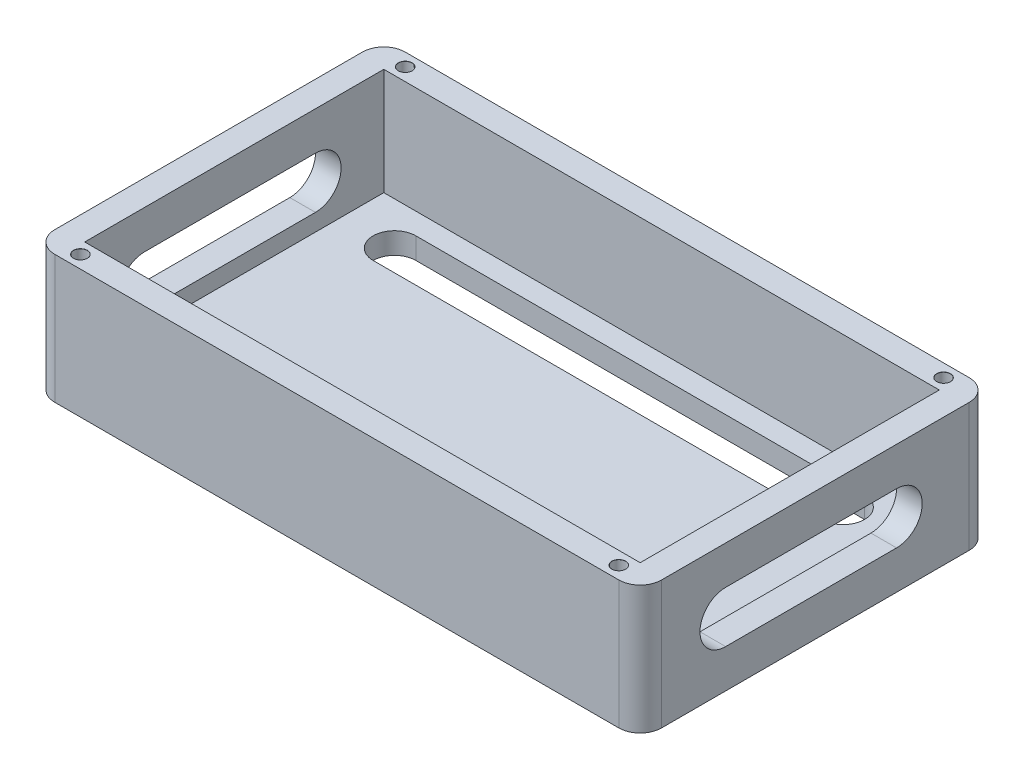
ISO-10303-21;
HEADER;
FILE_DESCRIPTION(('STEP AP214'),'2;1');
FILE_NAME('part.step','',(''),(''),'','','');
FILE_SCHEMA(('AUTOMOTIVE_DESIGN { 1 0 10303 214 1 1 1 1 }'));
ENDSEC;
DATA;
#1=APPLICATION_CONTEXT('core data for automotive mechanical design processes');
#2=APPLICATION_PROTOCOL_DEFINITION('international standard','automotive_design',2000,#1);
#3=PRODUCT_CONTEXT('',#1,'mechanical');
#4=PRODUCT('Part','Part','',(#3));
#5=PRODUCT_RELATED_PRODUCT_CATEGORY('part','',(#4));
#6=PRODUCT_DEFINITION_FORMATION('','',#4);
#7=PRODUCT_DEFINITION_CONTEXT('part definition',#1,'design');
#8=PRODUCT_DEFINITION('design','',#6,#7);
#9=PRODUCT_DEFINITION_SHAPE('','',#8);
#10=(LENGTH_UNIT() NAMED_UNIT(*) SI_UNIT(.MILLI.,.METRE.));
#11=(NAMED_UNIT(*) PLANE_ANGLE_UNIT() SI_UNIT($,.RADIAN.));
#12=(NAMED_UNIT(*) SI_UNIT($,.STERADIAN.) SOLID_ANGLE_UNIT());
#13=UNCERTAINTY_MEASURE_WITH_UNIT(LENGTH_MEASURE(1.E-05),#10,'distance_accuracy_value','');
#14=(GEOMETRIC_REPRESENTATION_CONTEXT(3) GLOBAL_UNCERTAINTY_ASSIGNED_CONTEXT((#13)) GLOBAL_UNIT_ASSIGNED_CONTEXT((#10,
#11,#12)) REPRESENTATION_CONTEXT('',''));
#15=CARTESIAN_POINT('',(0.,0.,0.));
#16=DIRECTION('',(0.,0.,1.));
#17=DIRECTION('',(1.,0.,0.));
#18=AXIS2_PLACEMENT_3D('',#15,#16,#17);
#19=CARTESIAN_POINT('',(71.,30.,41.));
#20=DIRECTION('',(-1.,0.,0.));
#21=DIRECTION('',(0.,0.,1.));
#22=AXIS2_PLACEMENT_3D('',#19,#20,#21);
#23=PLANE('',#22);
#24=DIRECTION('',(0.,0.,-1.));
#25=VECTOR('',#24,1.);
#26=CARTESIAN_POINT('',(71.,9.,21.));
#27=LINE('',#26,#25);
#28=CARTESIAN_POINT('',(71.,9.,21.));
#29=VERTEX_POINT('',#28);
#30=CARTESIAN_POINT('',(71.,9.,-19.));
#31=VERTEX_POINT('',#30);
#32=EDGE_CURVE('E265',#29,#31,#27,.T.);
#33=ORIENTED_EDGE('',*,*,#32,.F.);
#34=CARTESIAN_POINT('',(71.,15.,21.));
#35=DIRECTION('',(1.,0.,0.));
#36=DIRECTION('',(0.,0.,-1.));
#37=AXIS2_PLACEMENT_3D('',#34,#35,#36);
#38=CIRCLE('',#37,6.);
#39=CARTESIAN_POINT('',(71.,21.,21.));
#40=VERTEX_POINT('',#39);
#41=EDGE_CURVE('E55',#40,#29,#38,.T.);
#42=ORIENTED_EDGE('',*,*,#41,.F.);
#43=DIRECTION('',(0.,0.,1.));
#44=VECTOR('',#43,1.);
#45=CARTESIAN_POINT('',(71.,21.,21.));
#46=LINE('',#45,#44);
#47=CARTESIAN_POINT('',(71.,21.,-19.));
#48=VERTEX_POINT('',#47);
#49=EDGE_CURVE('E252',#48,#40,#46,.T.);
#50=ORIENTED_EDGE('',*,*,#49,.F.);
#51=CARTESIAN_POINT('',(71.,15.,-19.));
#52=DIRECTION('',(1.,0.,0.));
#53=DIRECTION('',(0.,0.,-1.));
#54=AXIS2_PLACEMENT_3D('',#51,#52,#53);
#55=CIRCLE('',#54,6.);
#56=EDGE_CURVE('E256',#31,#48,#55,.T.);
#57=ORIENTED_EDGE('',*,*,#56,.F.);
#58=EDGE_LOOP('',(#33,#42,#50,#57));
#59=FACE_BOUND('',#58,.T.);
#60=DIRECTION('',(0.,0.,-1.));
#61=VECTOR('',#60,1.);
#62=CARTESIAN_POINT('',(71.,0.,41.));
#63=LINE('',#62,#61);
#64=CARTESIAN_POINT('',(71.,0.,36.));
#65=VERTEX_POINT('',#64);
#66=CARTESIAN_POINT('',(71.,0.,-36.));
#67=VERTEX_POINT('',#66);
#68=EDGE_CURVE('E468',#65,#67,#63,.T.);
#69=ORIENTED_EDGE('',*,*,#68,.T.);
#70=DIRECTION('',(0.,-1.,0.));
#71=VECTOR('',#70,1.);
#72=CARTESIAN_POINT('',(71.,30.,-36.));
#73=LINE('',#72,#71);
#74=CARTESIAN_POINT('',(71.,30.,-36.));
#75=VERTEX_POINT('',#74);
#76=EDGE_CURVE('E551',#67,#75,#73,.F.);
#77=ORIENTED_EDGE('',*,*,#76,.T.);
#78=DIRECTION('',(0.,0.,-1.));
#79=VECTOR('',#78,1.);
#80=CARTESIAN_POINT('',(71.,30.,41.));
#81=LINE('',#80,#79);
#82=CARTESIAN_POINT('',(71.,30.,36.));
#83=VERTEX_POINT('',#82);
#84=EDGE_CURVE('E478',#83,#75,#81,.T.);
#85=ORIENTED_EDGE('',*,*,#84,.F.);
#86=DIRECTION('',(0.,-1.,0.));
#87=VECTOR('',#86,1.);
#88=CARTESIAN_POINT('',(71.,30.,36.));
#89=LINE('',#88,#87);
#90=EDGE_CURVE('E547',#83,#65,#89,.T.);
#91=ORIENTED_EDGE('',*,*,#90,.T.);
#92=EDGE_LOOP('',(#69,#77,#85,#91));
#93=FACE_BOUND('',#92,.T.);
#94=ADVANCED_FACE('F39',(#59,#93),#23,.F.);
#95=CARTESIAN_POINT('',(-71.,30.,-41.));
#96=DIRECTION('',(0.,0.,1.));
#97=DIRECTION('',(1.,0.,0.));
#98=AXIS2_PLACEMENT_3D('',#95,#96,#97);
#99=PLANE('',#98);
#100=DIRECTION('',(-1.,0.,0.));
#101=VECTOR('',#100,1.);
#102=CARTESIAN_POINT('',(-71.,0.,-41.));
#103=LINE('',#102,#101);
#104=CARTESIAN_POINT('',(66.,0.,-41.));
#105=VERTEX_POINT('',#104);
#106=CARTESIAN_POINT('',(-66.,0.,-41.));
#107=VERTEX_POINT('',#106);
#108=EDGE_CURVE('E499',#105,#107,#103,.T.);
#109=ORIENTED_EDGE('',*,*,#108,.T.);
#110=DIRECTION('',(0.,-1.,0.));
#111=VECTOR('',#110,1.);
#112=CARTESIAN_POINT('',(-66.,30.,-41.));
#113=LINE('',#112,#111);
#114=CARTESIAN_POINT('',(-66.,30.,-41.));
#115=VERTEX_POINT('',#114);
#116=EDGE_CURVE('E532',#107,#115,#113,.F.);
#117=ORIENTED_EDGE('',*,*,#116,.T.);
#118=DIRECTION('',(-1.,0.,0.));
#119=VECTOR('',#118,1.);
#120=CARTESIAN_POINT('',(-71.,30.,-41.));
#121=LINE('',#120,#119);
#122=CARTESIAN_POINT('',(66.,30.,-41.));
#123=VERTEX_POINT('',#122);
#124=EDGE_CURVE('E482',#123,#115,#121,.T.);
#125=ORIENTED_EDGE('',*,*,#124,.F.);
#126=DIRECTION('',(0.,-1.,0.));
#127=VECTOR('',#126,1.);
#128=CARTESIAN_POINT('',(66.,30.,-41.));
#129=LINE('',#128,#127);
#130=EDGE_CURVE('E528',#123,#105,#129,.T.);
#131=ORIENTED_EDGE('',*,*,#130,.T.);
#132=EDGE_LOOP('',(#109,#117,#125,#131));
#133=FACE_BOUND('',#132,.T.);
#134=ADVANCED_FACE('F590',(#133),#99,.F.);
#135=CARTESIAN_POINT('',(-71.,30.,41.));
#136=DIRECTION('',(1.,0.,0.));
#137=DIRECTION('',(0.,0.,-1.));
#138=AXIS2_PLACEMENT_3D('',#135,#136,#137);
#139=PLANE('',#138);
#140=DIRECTION('',(0.,0.,1.));
#141=VECTOR('',#140,1.);
#142=CARTESIAN_POINT('',(-71.,21.,21.));
#143=LINE('',#142,#141);
#144=CARTESIAN_POINT('',(-71.,21.,-19.));
#145=VERTEX_POINT('',#144);
#146=CARTESIAN_POINT('',(-71.,21.,21.));
#147=VERTEX_POINT('',#146);
#148=EDGE_CURVE('E250',#145,#147,#143,.T.);
#149=ORIENTED_EDGE('',*,*,#148,.T.);
#150=CARTESIAN_POINT('',(-71.,15.,21.));
#151=DIRECTION('',(1.,0.,0.));
#152=DIRECTION('',(0.,0.,-1.));
#153=AXIS2_PLACEMENT_3D('',#150,#151,#152);
#154=CIRCLE('',#153,6.);
#155=CARTESIAN_POINT('',(-71.,9.,21.));
#156=VERTEX_POINT('',#155);
#157=EDGE_CURVE('E232',#147,#156,#154,.T.);
#158=ORIENTED_EDGE('',*,*,#157,.T.);
#159=DIRECTION('',(0.,0.,-1.));
#160=VECTOR('',#159,1.);
#161=CARTESIAN_POINT('',(-71.,9.,21.));
#162=LINE('',#161,#160);
#163=CARTESIAN_POINT('',(-71.,9.,-19.));
#164=VERTEX_POINT('',#163);
#165=EDGE_CURVE('E241',#156,#164,#162,.T.);
#166=ORIENTED_EDGE('',*,*,#165,.T.);
#167=CARTESIAN_POINT('',(-71.,15.,-19.));
#168=DIRECTION('',(1.,0.,0.));
#169=DIRECTION('',(0.,0.,-1.));
#170=AXIS2_PLACEMENT_3D('',#167,#168,#169);
#171=CIRCLE('',#170,6.);
#172=EDGE_CURVE('E63',#164,#145,#171,.T.);
#173=ORIENTED_EDGE('',*,*,#172,.T.);
#174=EDGE_LOOP('',(#149,#158,#166,#173));
#175=FACE_BOUND('',#174,.T.);
#176=DIRECTION('',(0.,0.,1.));
#177=VECTOR('',#176,1.);
#178=CARTESIAN_POINT('',(-71.,30.,41.));
#179=LINE('',#178,#177);
#180=CARTESIAN_POINT('',(-71.,30.,-36.));
#181=VERTEX_POINT('',#180);
#182=CARTESIAN_POINT('',(-71.,30.,36.));
#183=VERTEX_POINT('',#182);
#184=EDGE_CURVE('E487',#181,#183,#179,.T.);
#185=ORIENTED_EDGE('',*,*,#184,.F.);
#186=DIRECTION('',(0.,-1.,0.));
#187=VECTOR('',#186,1.);
#188=CARTESIAN_POINT('',(-71.,30.,-36.));
#189=LINE('',#188,#187);
#190=CARTESIAN_POINT('',(-71.,0.,-36.));
#191=VERTEX_POINT('',#190);
#192=EDGE_CURVE('E512',#181,#191,#189,.T.);
#193=ORIENTED_EDGE('',*,*,#192,.T.);
#194=DIRECTION('',(0.,0.,1.));
#195=VECTOR('',#194,1.);
#196=CARTESIAN_POINT('',(-71.,0.,41.));
#197=LINE('',#196,#195);
#198=CARTESIAN_POINT('',(-71.,0.,36.));
#199=VERTEX_POINT('',#198);
#200=EDGE_CURVE('E503',#191,#199,#197,.T.);
#201=ORIENTED_EDGE('',*,*,#200,.T.);
#202=DIRECTION('',(0.,-1.,0.));
#203=VECTOR('',#202,1.);
#204=CARTESIAN_POINT('',(-71.,30.,36.));
#205=LINE('',#204,#203);
#206=EDGE_CURVE('E495',#199,#183,#205,.F.);
#207=ORIENTED_EDGE('',*,*,#206,.T.);
#208=EDGE_LOOP('',(#185,#193,#201,#207));
#209=FACE_BOUND('',#208,.T.);
#210=ADVANCED_FACE('F247',(#175,#209),#139,.F.);
#211=CARTESIAN_POINT('',(-71.,30.,41.));
#212=DIRECTION('',(0.,0.,-1.));
#213=DIRECTION('',(-1.,0.,0.));
#214=AXIS2_PLACEMENT_3D('',#211,#212,#213);
#215=PLANE('',#214);
#216=DIRECTION('',(1.,0.,0.));
#217=VECTOR('',#216,1.);
#218=CARTESIAN_POINT('',(-71.,0.,41.));
#219=LINE('',#218,#217);
#220=CARTESIAN_POINT('',(-66.,0.,41.));
#221=VERTEX_POINT('',#220);
#222=CARTESIAN_POINT('',(66.,0.,41.));
#223=VERTEX_POINT('',#222);
#224=EDGE_CURVE('E483',#221,#223,#219,.T.);
#225=ORIENTED_EDGE('',*,*,#224,.T.);
#226=DIRECTION('',(0.,-1.,0.));
#227=VECTOR('',#226,1.);
#228=CARTESIAN_POINT('',(66.,30.,41.));
#229=LINE('',#228,#227);
#230=CARTESIAN_POINT('',(66.,30.,41.));
#231=VERTEX_POINT('',#230);
#232=EDGE_CURVE('E558',#223,#231,#229,.F.);
#233=ORIENTED_EDGE('',*,*,#232,.T.);
#234=DIRECTION('',(1.,0.,0.));
#235=VECTOR('',#234,1.);
#236=CARTESIAN_POINT('',(-71.,30.,41.));
#237=LINE('',#236,#235);
#238=CARTESIAN_POINT('',(-66.,30.,41.));
#239=VERTEX_POINT('',#238);
#240=EDGE_CURVE('E491',#239,#231,#237,.T.);
#241=ORIENTED_EDGE('',*,*,#240,.F.);
#242=DIRECTION('',(0.,-1.,0.));
#243=VECTOR('',#242,1.);
#244=CARTESIAN_POINT('',(-66.,30.,41.));
#245=LINE('',#244,#243);
#246=EDGE_CURVE('E554',#239,#221,#245,.T.);
#247=ORIENTED_EDGE('',*,*,#246,.T.);
#248=EDGE_LOOP('',(#225,#233,#241,#247));
#249=FACE_BOUND('',#248,.T.);
#250=ADVANCED_FACE('F640',(#249),#215,.F.);
#251=CARTESIAN_POINT('',(0.,30.,0.));
#252=DIRECTION('',(0.,-1.,0.));
#253=DIRECTION('',(0.,0.,-1.));
#254=AXIS2_PLACEMENT_3D('',#251,#252,#253);
#255=PLANE('',#254);
#256=CARTESIAN_POINT('',(63.,30.,38.));
#257=DIRECTION('',(0.,1.,0.));
#258=DIRECTION('',(0.,0.,1.));
#259=AXIS2_PLACEMENT_3D('',#256,#257,#258);
#260=CIRCLE('',#259,1.625);
#261=CARTESIAN_POINT('',(63.,30.,39.625));
#262=VERTEX_POINT('',#261);
#263=EDGE_CURVE('E344',#262,#262,#260,.T.);
#264=ORIENTED_EDGE('',*,*,#263,.F.);
#265=EDGE_LOOP('',(#264));
#266=FACE_BOUND('',#265,.T.);
#267=CARTESIAN_POINT('',(63.,30.,-38.));
#268=DIRECTION('',(0.,1.,0.));
#269=DIRECTION('',(0.,0.,1.));
#270=AXIS2_PLACEMENT_3D('',#267,#268,#269);
#271=CIRCLE('',#270,1.625);
#272=CARTESIAN_POINT('',(63.,30.,-36.375));
#273=VERTEX_POINT('',#272);
#274=EDGE_CURVE('E397',#273,#273,#271,.T.);
#275=ORIENTED_EDGE('',*,*,#274,.F.);
#276=EDGE_LOOP('',(#275));
#277=FACE_BOUND('',#276,.T.);
#278=CARTESIAN_POINT('',(-63.,30.,-38.));
#279=DIRECTION('',(0.,1.,0.));
#280=DIRECTION('',(0.,0.,1.));
#281=AXIS2_PLACEMENT_3D('',#278,#279,#280);
#282=CIRCLE('',#281,1.625);
#283=CARTESIAN_POINT('',(-63.,30.,-36.375));
#284=VERTEX_POINT('',#283);
#285=EDGE_CURVE('E409',#284,#284,#282,.T.);
#286=ORIENTED_EDGE('',*,*,#285,.F.);
#287=EDGE_LOOP('',(#286));
#288=FACE_BOUND('',#287,.T.);
#289=CARTESIAN_POINT('',(-63.,30.,38.));
#290=DIRECTION('',(0.,1.,0.));
#291=DIRECTION('',(0.,0.,1.));
#292=AXIS2_PLACEMENT_3D('',#289,#290,#291);
#293=CIRCLE('',#292,1.625);
#294=CARTESIAN_POINT('',(-63.,30.,39.625));
#295=VERTEX_POINT('',#294);
#296=EDGE_CURVE('E421',#295,#295,#293,.T.);
#297=ORIENTED_EDGE('',*,*,#296,.F.);
#298=EDGE_LOOP('',(#297));
#299=FACE_BOUND('',#298,.T.);
#300=DIRECTION('',(-1.,0.,0.));
#301=VECTOR('',#300,1.);
#302=CARTESIAN_POINT('',(-65.,30.,-35.));
#303=LINE('',#302,#301);
#304=CARTESIAN_POINT('',(65.,30.,-35.));
#305=VERTEX_POINT('',#304);
#306=CARTESIAN_POINT('',(-65.,30.,-35.));
#307=VERTEX_POINT('',#306);
#308=EDGE_CURVE('E454',#305,#307,#303,.T.);
#309=ORIENTED_EDGE('',*,*,#308,.F.);
#310=DIRECTION('',(0.,0.,-1.));
#311=VECTOR('',#310,1.);
#312=CARTESIAN_POINT('',(65.,30.,35.));
#313=LINE('',#312,#311);
#314=CARTESIAN_POINT('',(65.,30.,35.));
#315=VERTEX_POINT('',#314);
#316=EDGE_CURVE('E433',#315,#305,#313,.T.);
#317=ORIENTED_EDGE('',*,*,#316,.F.);
#318=DIRECTION('',(1.,0.,0.));
#319=VECTOR('',#318,1.);
#320=CARTESIAN_POINT('',(-65.,30.,35.));
#321=LINE('',#320,#319);
#322=CARTESIAN_POINT('',(-65.,30.,35.));
#323=VERTEX_POINT('',#322);
#324=EDGE_CURVE('E439',#323,#315,#321,.T.);
#325=ORIENTED_EDGE('',*,*,#324,.F.);
#326=DIRECTION('',(0.,0.,1.));
#327=VECTOR('',#326,1.);
#328=CARTESIAN_POINT('',(-65.,30.,35.));
#329=LINE('',#328,#327);
#330=EDGE_CURVE('E458',#307,#323,#329,.T.);
#331=ORIENTED_EDGE('',*,*,#330,.F.);
#332=EDGE_LOOP('',(#309,#317,#325,#331));
#333=FACE_BOUND('',#332,.T.);
#334=ORIENTED_EDGE('',*,*,#124,.T.);
#335=CARTESIAN_POINT('',(-66.,30.,-36.));
#336=DIRECTION('',(0.,-1.,0.));
#337=DIRECTION('',(0.,0.,-1.));
#338=AXIS2_PLACEMENT_3D('',#335,#336,#337);
#339=CIRCLE('',#338,5.);
#340=EDGE_CURVE('E544',#115,#181,#339,.F.);
#341=ORIENTED_EDGE('',*,*,#340,.T.);
#342=ORIENTED_EDGE('',*,*,#184,.T.);
#343=CARTESIAN_POINT('',(-66.,30.,36.));
#344=DIRECTION('',(0.,-1.,0.));
#345=DIRECTION('',(0.,0.,-1.));
#346=AXIS2_PLACEMENT_3D('',#343,#344,#345);
#347=CIRCLE('',#346,5.);
#348=EDGE_CURVE('E535',#183,#239,#347,.F.);
#349=ORIENTED_EDGE('',*,*,#348,.T.);
#350=ORIENTED_EDGE('',*,*,#240,.T.);
#351=CARTESIAN_POINT('',(66.,30.,36.));
#352=DIRECTION('',(0.,-1.,0.));
#353=DIRECTION('',(0.,0.,-1.));
#354=AXIS2_PLACEMENT_3D('',#351,#352,#353);
#355=CIRCLE('',#354,5.);
#356=EDGE_CURVE('E538',#231,#83,#355,.F.);
#357=ORIENTED_EDGE('',*,*,#356,.T.);
#358=ORIENTED_EDGE('',*,*,#84,.T.);
#359=CARTESIAN_POINT('',(66.,30.,-36.));
#360=DIRECTION('',(0.,-1.,0.));
#361=DIRECTION('',(0.,0.,-1.));
#362=AXIS2_PLACEMENT_3D('',#359,#360,#361);
#363=CIRCLE('',#362,5.);
#364=EDGE_CURVE('E541',#75,#123,#363,.F.);
#365=ORIENTED_EDGE('',*,*,#364,.T.);
#366=EDGE_LOOP('',(#334,#341,#342,#349,#350,#357,#358,#365));
#367=FACE_BOUND('',#366,.T.);
#368=ADVANCED_FACE('F623',(#266,#277,#288,#299,#333,#367),#255,.F.);
#369=CARTESIAN_POINT('',(0.,0.,0.));
#370=DIRECTION('',(0.,-1.,0.));
#371=DIRECTION('',(0.,0.,-1.));
#372=AXIS2_PLACEMENT_3D('',#369,#370,#371);
#373=PLANE('',#372);
#374=CARTESIAN_POINT('',(52.5,0.,25.));
#375=DIRECTION('',(0.,-1.,0.));
#376=DIRECTION('',(0.,0.,-1.));
#377=AXIS2_PLACEMENT_3D('',#374,#375,#376);
#378=CIRCLE('',#377,5.);
#379=CARTESIAN_POINT('',(52.5,0.,30.));
#380=VERTEX_POINT('',#379);
#381=CARTESIAN_POINT('',(52.5,0.,20.));
#382=VERTEX_POINT('',#381);
#383=EDGE_CURVE('E308',#380,#382,#378,.F.);
#384=ORIENTED_EDGE('',*,*,#383,.T.);
#385=DIRECTION('',(-1.,0.,0.));
#386=VECTOR('',#385,1.);
#387=CARTESIAN_POINT('',(52.5,0.,20.));
#388=LINE('',#387,#386);
#389=CARTESIAN_POINT('',(-52.5,0.,20.));
#390=VERTEX_POINT('',#389);
#391=EDGE_CURVE('E331',#382,#390,#388,.T.);
#392=ORIENTED_EDGE('',*,*,#391,.T.);
#393=CARTESIAN_POINT('',(-52.5,0.,25.));
#394=DIRECTION('',(0.,-1.,0.));
#395=DIRECTION('',(0.,0.,-1.));
#396=AXIS2_PLACEMENT_3D('',#393,#394,#395);
#397=CIRCLE('',#396,5.);
#398=CARTESIAN_POINT('',(-52.5,0.,30.));
#399=VERTEX_POINT('',#398);
#400=EDGE_CURVE('E300',#390,#399,#397,.F.);
#401=ORIENTED_EDGE('',*,*,#400,.T.);
#402=DIRECTION('',(-1.,0.,0.));
#403=VECTOR('',#402,1.);
#404=CARTESIAN_POINT('',(52.5,0.,30.));
#405=LINE('',#404,#403);
#406=EDGE_CURVE('E304',#380,#399,#405,.T.);
#407=ORIENTED_EDGE('',*,*,#406,.F.);
#408=EDGE_LOOP('',(#384,#392,#401,#407));
#409=FACE_BOUND('',#408,.T.);
#410=CARTESIAN_POINT('',(52.5,0.,-25.));
#411=DIRECTION('',(0.,-1.,0.));
#412=DIRECTION('',(0.,0.,-1.));
#413=AXIS2_PLACEMENT_3D('',#410,#411,#412);
#414=CIRCLE('',#413,5.);
#415=CARTESIAN_POINT('',(52.5,0.,-20.));
#416=VERTEX_POINT('',#415);
#417=CARTESIAN_POINT('',(52.5,0.,-30.));
#418=VERTEX_POINT('',#417);
#419=EDGE_CURVE('E376',#416,#418,#414,.F.);
#420=ORIENTED_EDGE('',*,*,#419,.T.);
#421=DIRECTION('',(-1.,0.,0.));
#422=VECTOR('',#421,1.);
#423=CARTESIAN_POINT('',(52.5,0.,-30.));
#424=LINE('',#423,#422);
#425=CARTESIAN_POINT('',(-52.5,0.,-30.));
#426=VERTEX_POINT('',#425);
#427=EDGE_CURVE('E299',#418,#426,#424,.T.);
#428=ORIENTED_EDGE('',*,*,#427,.T.);
#429=CARTESIAN_POINT('',(-52.5,0.,-25.));
#430=DIRECTION('',(0.,-1.,0.));
#431=DIRECTION('',(0.,0.,-1.));
#432=AXIS2_PLACEMENT_3D('',#429,#430,#431);
#433=CIRCLE('',#432,5.);
#434=CARTESIAN_POINT('',(-52.5,0.,-20.));
#435=VERTEX_POINT('',#434);
#436=EDGE_CURVE('E305',#426,#435,#433,.F.);
#437=ORIENTED_EDGE('',*,*,#436,.T.);
#438=DIRECTION('',(-1.,0.,0.));
#439=VECTOR('',#438,1.);
#440=CARTESIAN_POINT('',(52.5,0.,-20.));
#441=LINE('',#440,#439);
#442=EDGE_CURVE('E380',#416,#435,#441,.T.);
#443=ORIENTED_EDGE('',*,*,#442,.F.);
#444=EDGE_LOOP('',(#420,#428,#437,#443));
#445=FACE_BOUND('',#444,.T.);
#446=CARTESIAN_POINT('',(63.,0.,38.));
#447=DIRECTION('',(0.,1.,0.));
#448=DIRECTION('',(0.,0.,1.));
#449=AXIS2_PLACEMENT_3D('',#446,#447,#448);
#450=CIRCLE('',#449,1.59999999999999);
#451=CARTESIAN_POINT('',(63.,0.,39.6));
#452=VERTEX_POINT('',#451);
#453=EDGE_CURVE('E393',#452,#452,#450,.T.);
#454=ORIENTED_EDGE('',*,*,#453,.T.);
#455=EDGE_LOOP('',(#454));
#456=FACE_BOUND('',#455,.T.);
#457=CARTESIAN_POINT('',(63.,0.,-38.));
#458=DIRECTION('',(0.,1.,0.));
#459=DIRECTION('',(0.,0.,1.));
#460=AXIS2_PLACEMENT_3D('',#457,#458,#459);
#461=CIRCLE('',#460,1.59999999999999);
#462=CARTESIAN_POINT('',(63.,0.,-36.4));
#463=VERTEX_POINT('',#462);
#464=EDGE_CURVE('E405',#463,#463,#461,.T.);
#465=ORIENTED_EDGE('',*,*,#464,.T.);
#466=EDGE_LOOP('',(#465));
#467=FACE_BOUND('',#466,.T.);
#468=CARTESIAN_POINT('',(-63.,0.,-38.));
#469=DIRECTION('',(0.,1.,0.));
#470=DIRECTION('',(0.,0.,1.));
#471=AXIS2_PLACEMENT_3D('',#468,#469,#470);
#472=CIRCLE('',#471,1.59999999999999);
#473=CARTESIAN_POINT('',(-63.,0.,-36.4));
#474=VERTEX_POINT('',#473);
#475=EDGE_CURVE('E417',#474,#474,#472,.T.);
#476=ORIENTED_EDGE('',*,*,#475,.T.);
#477=EDGE_LOOP('',(#476));
#478=FACE_BOUND('',#477,.T.);
#479=CARTESIAN_POINT('',(-63.,0.,38.));
#480=DIRECTION('',(0.,1.,0.));
#481=DIRECTION('',(0.,0.,1.));
#482=AXIS2_PLACEMENT_3D('',#479,#480,#481);
#483=CIRCLE('',#482,1.59999999999999);
#484=CARTESIAN_POINT('',(-63.,0.,39.6));
#485=VERTEX_POINT('',#484);
#486=EDGE_CURVE('E429',#485,#485,#483,.T.);
#487=ORIENTED_EDGE('',*,*,#486,.T.);
#488=EDGE_LOOP('',(#487));
#489=FACE_BOUND('',#488,.T.);
#490=ORIENTED_EDGE('',*,*,#200,.F.);
#491=CARTESIAN_POINT('',(-66.,0.,-36.));
#492=DIRECTION('',(0.,-1.,0.));
#493=DIRECTION('',(0.,0.,-1.));
#494=AXIS2_PLACEMENT_3D('',#491,#492,#493);
#495=CIRCLE('',#494,5.);
#496=EDGE_CURVE('E525',#191,#107,#495,.T.);
#497=ORIENTED_EDGE('',*,*,#496,.T.);
#498=ORIENTED_EDGE('',*,*,#108,.F.);
#499=CARTESIAN_POINT('',(66.,0.,-36.));
#500=DIRECTION('',(0.,-1.,0.));
#501=DIRECTION('',(0.,0.,-1.));
#502=AXIS2_PLACEMENT_3D('',#499,#500,#501);
#503=CIRCLE('',#502,5.);
#504=EDGE_CURVE('E522',#105,#67,#503,.T.);
#505=ORIENTED_EDGE('',*,*,#504,.T.);
#506=ORIENTED_EDGE('',*,*,#68,.F.);
#507=CARTESIAN_POINT('',(66.,0.,36.));
#508=DIRECTION('',(0.,-1.,0.));
#509=DIRECTION('',(0.,0.,-1.));
#510=AXIS2_PLACEMENT_3D('',#507,#508,#509);
#511=CIRCLE('',#510,5.);
#512=EDGE_CURVE('E519',#65,#223,#511,.T.);
#513=ORIENTED_EDGE('',*,*,#512,.T.);
#514=ORIENTED_EDGE('',*,*,#224,.F.);
#515=CARTESIAN_POINT('',(-66.,0.,36.));
#516=DIRECTION('',(0.,-1.,0.));
#517=DIRECTION('',(0.,0.,-1.));
#518=AXIS2_PLACEMENT_3D('',#515,#516,#517);
#519=CIRCLE('',#518,5.);
#520=EDGE_CURVE('E516',#221,#199,#519,.T.);
#521=ORIENTED_EDGE('',*,*,#520,.T.);
#522=EDGE_LOOP('',(#490,#497,#498,#505,#506,#513,#514,#521));
#523=FACE_BOUND('',#522,.T.);
#524=ADVANCED_FACE('F643',(#409,#445,#456,#467,#478,#489,#523),#373,.T.);
#525=CARTESIAN_POINT('',(65.,5.,35.));
#526=DIRECTION('',(1.,0.,0.));
#527=DIRECTION('',(0.,0.,-1.));
#528=AXIS2_PLACEMENT_3D('',#525,#526,#527);
#529=PLANE('',#528);
#530=DIRECTION('',(0.,0.,1.));
#531=VECTOR('',#530,1.);
#532=CARTESIAN_POINT('',(65.,21.,35.));
#533=LINE('',#532,#531);
#534=CARTESIAN_POINT('',(65.,21.,-19.));
#535=VERTEX_POINT('',#534);
#536=CARTESIAN_POINT('',(65.,21.,21.));
#537=VERTEX_POINT('',#536);
#538=EDGE_CURVE('E291',#535,#537,#533,.T.);
#539=ORIENTED_EDGE('',*,*,#538,.T.);
#540=CARTESIAN_POINT('',(65.,15.,21.));
#541=DIRECTION('',(1.,0.,0.));
#542=DIRECTION('',(0.,0.,-1.));
#543=AXIS2_PLACEMENT_3D('',#540,#541,#542);
#544=CIRCLE('',#543,6.);
#545=CARTESIAN_POINT('',(65.,9.,21.));
#546=VERTEX_POINT('',#545);
#547=EDGE_CURVE('E295',#537,#546,#544,.T.);
#548=ORIENTED_EDGE('',*,*,#547,.T.);
#549=DIRECTION('',(0.,0.,-1.));
#550=VECTOR('',#549,1.);
#551=CARTESIAN_POINT('',(65.,9.,35.));
#552=LINE('',#551,#550);
#553=CARTESIAN_POINT('',(65.,9.,-19.));
#554=VERTEX_POINT('',#553);
#555=EDGE_CURVE('E275',#546,#554,#552,.T.);
#556=ORIENTED_EDGE('',*,*,#555,.T.);
#557=CARTESIAN_POINT('',(65.,15.,-19.));
#558=DIRECTION('',(1.,0.,0.));
#559=DIRECTION('',(0.,0.,-1.));
#560=AXIS2_PLACEMENT_3D('',#557,#558,#559);
#561=CIRCLE('',#560,6.);
#562=EDGE_CURVE('E287',#554,#535,#561,.T.);
#563=ORIENTED_EDGE('',*,*,#562,.T.);
#564=EDGE_LOOP('',(#539,#548,#556,#563));
#565=FACE_BOUND('',#564,.T.);
#566=ORIENTED_EDGE('',*,*,#316,.T.);
#567=DIRECTION('',(0.,1.,0.));
#568=VECTOR('',#567,1.);
#569=CARTESIAN_POINT('',(65.,5.,-35.));
#570=LINE('',#569,#568);
#571=CARTESIAN_POINT('',(65.,5.,-35.));
#572=VERTEX_POINT('',#571);
#573=EDGE_CURVE('E451',#572,#305,#570,.T.);
#574=ORIENTED_EDGE('',*,*,#573,.F.);
#575=DIRECTION('',(0.,0.,-1.));
#576=VECTOR('',#575,1.);
#577=CARTESIAN_POINT('',(65.,5.,35.));
#578=LINE('',#577,#576);
#579=CARTESIAN_POINT('',(65.,5.,35.));
#580=VERTEX_POINT('',#579);
#581=EDGE_CURVE('E434',#580,#572,#578,.T.);
#582=ORIENTED_EDGE('',*,*,#581,.F.);
#583=DIRECTION('',(0.,1.,0.));
#584=VECTOR('',#583,1.);
#585=CARTESIAN_POINT('',(65.,5.,35.));
#586=LINE('',#585,#584);
#587=EDGE_CURVE('E465',#580,#315,#586,.T.);
#588=ORIENTED_EDGE('',*,*,#587,.T.);
#589=EDGE_LOOP('',(#566,#574,#582,#588));
#590=FACE_BOUND('',#589,.T.);
#591=ADVANCED_FACE('F645',(#565,#590),#529,.F.);
#592=CARTESIAN_POINT('',(-65.,5.,35.));
#593=DIRECTION('',(0.,0.,1.));
#594=DIRECTION('',(1.,0.,0.));
#595=AXIS2_PLACEMENT_3D('',#592,#593,#594);
#596=PLANE('',#595);
#597=ORIENTED_EDGE('',*,*,#324,.T.);
#598=ORIENTED_EDGE('',*,*,#587,.F.);
#599=DIRECTION('',(1.,0.,0.));
#600=VECTOR('',#599,1.);
#601=CARTESIAN_POINT('',(-65.,5.,35.));
#602=LINE('',#601,#600);
#603=CARTESIAN_POINT('',(-65.,5.,35.));
#604=VERTEX_POINT('',#603);
#605=EDGE_CURVE('E447',#604,#580,#602,.T.);
#606=ORIENTED_EDGE('',*,*,#605,.F.);
#607=DIRECTION('',(0.,1.,0.));
#608=VECTOR('',#607,1.);
#609=CARTESIAN_POINT('',(-65.,5.,35.));
#610=LINE('',#609,#608);
#611=EDGE_CURVE('E469',#604,#323,#610,.T.);
#612=ORIENTED_EDGE('',*,*,#611,.T.);
#613=EDGE_LOOP('',(#597,#598,#606,#612));
#614=FACE_BOUND('',#613,.T.);
#615=ADVANCED_FACE('F652',(#614),#596,.F.);
#616=CARTESIAN_POINT('',(-65.,5.,35.));
#617=DIRECTION('',(-1.,0.,0.));
#618=DIRECTION('',(0.,0.,1.));
#619=AXIS2_PLACEMENT_3D('',#616,#617,#618);
#620=PLANE('',#619);
#621=DIRECTION('',(0.,0.,1.));
#622=VECTOR('',#621,1.);
#623=CARTESIAN_POINT('',(-65.,9.,35.));
#624=LINE('',#623,#622);
#625=CARTESIAN_POINT('',(-65.,9.,-19.));
#626=VERTEX_POINT('',#625);
#627=CARTESIAN_POINT('',(-65.,9.,21.));
#628=VERTEX_POINT('',#627);
#629=EDGE_CURVE('E561',#626,#628,#624,.T.);
#630=ORIENTED_EDGE('',*,*,#629,.T.);
#631=CARTESIAN_POINT('',(-65.,15.,21.));
#632=DIRECTION('',(-1.,0.,0.));
#633=DIRECTION('',(0.,0.,1.));
#634=AXIS2_PLACEMENT_3D('',#631,#632,#633);
#635=CIRCLE('',#634,6.);
#636=CARTESIAN_POINT('',(-65.,21.,21.));
#637=VERTEX_POINT('',#636);
#638=EDGE_CURVE('E11',#628,#637,#635,.T.);
#639=ORIENTED_EDGE('',*,*,#638,.T.);
#640=DIRECTION('',(0.,0.,-1.));
#641=VECTOR('',#640,1.);
#642=CARTESIAN_POINT('',(-65.,21.,35.));
#643=LINE('',#642,#641);
#644=CARTESIAN_POINT('',(-65.,21.,-19.));
#645=VERTEX_POINT('',#644);
#646=EDGE_CURVE('E48',#637,#645,#643,.T.);
#647=ORIENTED_EDGE('',*,*,#646,.T.);
#648=CARTESIAN_POINT('',(-65.,15.,-19.));
#649=DIRECTION('',(-1.,0.,0.));
#650=DIRECTION('',(0.,0.,1.));
#651=AXIS2_PLACEMENT_3D('',#648,#649,#650);
#652=CIRCLE('',#651,6.);
#653=EDGE_CURVE('E564',#645,#626,#652,.T.);
#654=ORIENTED_EDGE('',*,*,#653,.T.);
#655=EDGE_LOOP('',(#630,#639,#647,#654));
#656=FACE_BOUND('',#655,.T.);
#657=ORIENTED_EDGE('',*,*,#330,.T.);
#658=ORIENTED_EDGE('',*,*,#611,.F.);
#659=DIRECTION('',(0.,0.,1.));
#660=VECTOR('',#659,1.);
#661=CARTESIAN_POINT('',(-65.,5.,35.));
#662=LINE('',#661,#660);
#663=CARTESIAN_POINT('',(-65.,5.,-35.));
#664=VERTEX_POINT('',#663);
#665=EDGE_CURVE('E443',#664,#604,#662,.T.);
#666=ORIENTED_EDGE('',*,*,#665,.F.);
#667=DIRECTION('',(0.,1.,0.));
#668=VECTOR('',#667,1.);
#669=CARTESIAN_POINT('',(-65.,5.,-35.));
#670=LINE('',#669,#668);
#671=EDGE_CURVE('E472',#664,#307,#670,.T.);
#672=ORIENTED_EDGE('',*,*,#671,.T.);
#673=EDGE_LOOP('',(#657,#658,#666,#672));
#674=FACE_BOUND('',#673,.T.);
#675=ADVANCED_FACE('F570',(#656,#674),#620,.F.);
#676=CARTESIAN_POINT('',(-65.,5.,-35.));
#677=DIRECTION('',(0.,0.,-1.));
#678=DIRECTION('',(-1.,0.,0.));
#679=AXIS2_PLACEMENT_3D('',#676,#677,#678);
#680=PLANE('',#679);
#681=ORIENTED_EDGE('',*,*,#308,.T.);
#682=ORIENTED_EDGE('',*,*,#671,.F.);
#683=DIRECTION('',(-1.,0.,0.));
#684=VECTOR('',#683,1.);
#685=CARTESIAN_POINT('',(-65.,5.,-35.));
#686=LINE('',#685,#684);
#687=EDGE_CURVE('E438',#572,#664,#686,.T.);
#688=ORIENTED_EDGE('',*,*,#687,.F.);
#689=ORIENTED_EDGE('',*,*,#573,.T.);
#690=EDGE_LOOP('',(#681,#682,#688,#689));
#691=FACE_BOUND('',#690,.T.);
#692=ADVANCED_FACE('F774',(#691),#680,.F.);
#693=CARTESIAN_POINT('',(0.,5.,0.));
#694=DIRECTION('',(0.,-1.,0.));
#695=DIRECTION('',(0.,0.,-1.));
#696=AXIS2_PLACEMENT_3D('',#693,#694,#695);
#697=PLANE('',#696);
#698=DIRECTION('',(-1.,0.,0.));
#699=VECTOR('',#698,1.);
#700=CARTESIAN_POINT('',(52.5,5.,20.));
#701=LINE('',#700,#699);
#702=CARTESIAN_POINT('',(52.5,5.,20.));
#703=VERTEX_POINT('',#702);
#704=CARTESIAN_POINT('',(-52.5,5.,20.));
#705=VERTEX_POINT('',#704);
#706=EDGE_CURVE('E315',#703,#705,#701,.T.);
#707=ORIENTED_EDGE('',*,*,#706,.F.);
#708=CARTESIAN_POINT('',(52.5,5.,25.));
#709=DIRECTION('',(0.,1.,0.));
#710=DIRECTION('',(0.,0.,1.));
#711=AXIS2_PLACEMENT_3D('',#708,#709,#710);
#712=CIRCLE('',#711,5.);
#713=CARTESIAN_POINT('',(52.5,5.,30.));
#714=VERTEX_POINT('',#713);
#715=EDGE_CURVE('E312',#714,#703,#712,.T.);
#716=ORIENTED_EDGE('',*,*,#715,.F.);
#717=DIRECTION('',(-1.,0.,0.));
#718=VECTOR('',#717,1.);
#719=CARTESIAN_POINT('',(52.5,5.,30.));
#720=LINE('',#719,#718);
#721=CARTESIAN_POINT('',(-52.5,5.,30.));
#722=VERTEX_POINT('',#721);
#723=EDGE_CURVE('E323',#714,#722,#720,.T.);
#724=ORIENTED_EDGE('',*,*,#723,.T.);
#725=CARTESIAN_POINT('',(-52.5,5.,25.));
#726=DIRECTION('',(0.,1.,0.));
#727=DIRECTION('',(0.,0.,1.));
#728=AXIS2_PLACEMENT_3D('',#725,#726,#727);
#729=CIRCLE('',#728,5.);
#730=EDGE_CURVE('E319',#705,#722,#729,.T.);
#731=ORIENTED_EDGE('',*,*,#730,.F.);
#732=EDGE_LOOP('',(#707,#716,#724,#731));
#733=FACE_BOUND('',#732,.T.);
#734=DIRECTION('',(-1.,0.,0.));
#735=VECTOR('',#734,1.);
#736=CARTESIAN_POINT('',(52.5,5.,-30.));
#737=LINE('',#736,#735);
#738=CARTESIAN_POINT('',(52.5,5.,-30.));
#739=VERTEX_POINT('',#738);
#740=CARTESIAN_POINT('',(-52.5,5.,-30.));
#741=VERTEX_POINT('',#740);
#742=EDGE_CURVE('E369',#739,#741,#737,.T.);
#743=ORIENTED_EDGE('',*,*,#742,.F.);
#744=CARTESIAN_POINT('',(52.5,5.,-25.));
#745=DIRECTION('',(0.,1.,0.));
#746=DIRECTION('',(0.,0.,1.));
#747=AXIS2_PLACEMENT_3D('',#744,#745,#746);
#748=CIRCLE('',#747,5.);
#749=CARTESIAN_POINT('',(52.5,5.,-20.));
#750=VERTEX_POINT('',#749);
#751=EDGE_CURVE('E373',#750,#739,#748,.T.);
#752=ORIENTED_EDGE('',*,*,#751,.F.);
#753=DIRECTION('',(-1.,0.,0.));
#754=VECTOR('',#753,1.);
#755=CARTESIAN_POINT('',(52.5,5.,-20.));
#756=LINE('',#755,#754);
#757=CARTESIAN_POINT('',(-52.5,5.,-20.));
#758=VERTEX_POINT('',#757);
#759=EDGE_CURVE('E353',#750,#758,#756,.T.);
#760=ORIENTED_EDGE('',*,*,#759,.T.);
#761=CARTESIAN_POINT('',(-52.5,5.,-25.));
#762=DIRECTION('',(0.,1.,0.));
#763=DIRECTION('',(0.,0.,1.));
#764=AXIS2_PLACEMENT_3D('',#761,#762,#763);
#765=CIRCLE('',#764,5.);
#766=EDGE_CURVE('E365',#741,#758,#765,.T.);
#767=ORIENTED_EDGE('',*,*,#766,.F.);
#768=EDGE_LOOP('',(#743,#752,#760,#767));
#769=FACE_BOUND('',#768,.T.);
#770=ORIENTED_EDGE('',*,*,#581,.T.);
#771=ORIENTED_EDGE('',*,*,#687,.T.);
#772=ORIENTED_EDGE('',*,*,#665,.T.);
#773=ORIENTED_EDGE('',*,*,#605,.T.);
#774=EDGE_LOOP('',(#770,#771,#772,#773));
#775=FACE_BOUND('',#774,.T.);
#776=ADVANCED_FACE('F606',(#733,#769,#775),#697,.F.);
#777=CARTESIAN_POINT('',(-66.,30.,-36.));
#778=DIRECTION('',(0.,-1.,0.));
#779=DIRECTION('',(0.,0.,-1.));
#780=AXIS2_PLACEMENT_3D('',#777,#778,#779);
#781=CYLINDRICAL_SURFACE('',#780,5.);
#782=ORIENTED_EDGE('',*,*,#340,.F.);
#783=ORIENTED_EDGE('',*,*,#116,.F.);
#784=ORIENTED_EDGE('',*,*,#496,.F.);
#785=ORIENTED_EDGE('',*,*,#192,.F.);
#786=EDGE_LOOP('',(#782,#783,#784,#785));
#787=FACE_BOUND('',#786,.T.);
#788=ADVANCED_FACE('F602',(#787),#781,.T.);
#789=CARTESIAN_POINT('',(66.,30.,-36.));
#790=DIRECTION('',(0.,-1.,0.));
#791=DIRECTION('',(0.,0.,-1.));
#792=AXIS2_PLACEMENT_3D('',#789,#790,#791);
#793=CYLINDRICAL_SURFACE('',#792,5.);
#794=ORIENTED_EDGE('',*,*,#364,.F.);
#795=ORIENTED_EDGE('',*,*,#76,.F.);
#796=ORIENTED_EDGE('',*,*,#504,.F.);
#797=ORIENTED_EDGE('',*,*,#130,.F.);
#798=EDGE_LOOP('',(#794,#795,#796,#797));
#799=FACE_BOUND('',#798,.T.);
#800=ADVANCED_FACE('F605',(#799),#793,.T.);
#801=CARTESIAN_POINT('',(66.,30.,36.));
#802=DIRECTION('',(0.,-1.,0.));
#803=DIRECTION('',(0.,0.,-1.));
#804=AXIS2_PLACEMENT_3D('',#801,#802,#803);
#805=CYLINDRICAL_SURFACE('',#804,5.);
#806=ORIENTED_EDGE('',*,*,#356,.F.);
#807=ORIENTED_EDGE('',*,*,#232,.F.);
#808=ORIENTED_EDGE('',*,*,#512,.F.);
#809=ORIENTED_EDGE('',*,*,#90,.F.);
#810=EDGE_LOOP('',(#806,#807,#808,#809));
#811=FACE_BOUND('',#810,.T.);
#812=ADVANCED_FACE('F609',(#811),#805,.T.);
#813=CARTESIAN_POINT('',(-66.,30.,36.));
#814=DIRECTION('',(0.,-1.,0.));
#815=DIRECTION('',(0.,0.,-1.));
#816=AXIS2_PLACEMENT_3D('',#813,#814,#815);
#817=CYLINDRICAL_SURFACE('',#816,5.);
#818=ORIENTED_EDGE('',*,*,#348,.F.);
#819=ORIENTED_EDGE('',*,*,#206,.F.);
#820=ORIENTED_EDGE('',*,*,#520,.F.);
#821=ORIENTED_EDGE('',*,*,#246,.F.);
#822=EDGE_LOOP('',(#818,#819,#820,#821));
#823=FACE_BOUND('',#822,.T.);
#824=ADVANCED_FACE('F41',(#823),#817,.T.);
#825=CARTESIAN_POINT('',(-63.,30.,38.));
#826=DIRECTION('',(0.,1.,0.));
#827=DIRECTION('',(0.,0.,1.));
#828=AXIS2_PLACEMENT_3D('',#825,#826,#827);
#829=CYLINDRICAL_SURFACE('',#828,1.59999999999999);
#830=ORIENTED_EDGE('',*,*,#486,.F.);
#831=EDGE_LOOP('',(#830));
#832=FACE_BOUND('',#831,.T.);
#833=CARTESIAN_POINT('',(-63.,29.975,38.));
#834=DIRECTION('',(0.,1.,0.));
#835=DIRECTION('',(0.,0.,1.));
#836=AXIS2_PLACEMENT_3D('',#833,#834,#835);
#837=CIRCLE('',#836,1.6);
#838=CARTESIAN_POINT('',(-63.,29.975,39.6));
#839=VERTEX_POINT('',#838);
#840=EDGE_CURVE('E425',#839,#839,#837,.T.);
#841=ORIENTED_EDGE('',*,*,#840,.T.);
#842=EDGE_LOOP('',(#841));
#843=FACE_BOUND('',#842,.T.);
#844=ADVANCED_FACE('F616',(#832,#843),#829,.F.);
#845=CARTESIAN_POINT('',(-63.,30.,38.));
#846=DIRECTION('',(0.,1.,0.));
#847=DIRECTION('',(0.,0.,1.));
#848=AXIS2_PLACEMENT_3D('',#845,#846,#847);
#849=CONICAL_SURFACE('',#848,1.625,0.785398163397379);
#850=ORIENTED_EDGE('',*,*,#840,.F.);
#851=EDGE_LOOP('',(#850));
#852=FACE_BOUND('',#851,.T.);
#853=ORIENTED_EDGE('',*,*,#296,.T.);
#854=EDGE_LOOP('',(#853));
#855=FACE_BOUND('',#854,.T.);
#856=ADVANCED_FACE('F688',(#852,#855),#849,.F.);
#857=CARTESIAN_POINT('',(-63.,30.,-38.));
#858=DIRECTION('',(0.,1.,0.));
#859=DIRECTION('',(0.,0.,1.));
#860=AXIS2_PLACEMENT_3D('',#857,#858,#859);
#861=CYLINDRICAL_SURFACE('',#860,1.59999999999999);
#862=ORIENTED_EDGE('',*,*,#475,.F.);
#863=EDGE_LOOP('',(#862));
#864=FACE_BOUND('',#863,.T.);
#865=CARTESIAN_POINT('',(-63.,29.975,-38.));
#866=DIRECTION('',(0.,1.,0.));
#867=DIRECTION('',(0.,0.,1.));
#868=AXIS2_PLACEMENT_3D('',#865,#866,#867);
#869=CIRCLE('',#868,1.6);
#870=CARTESIAN_POINT('',(-63.,29.975,-36.4));
#871=VERTEX_POINT('',#870);
#872=EDGE_CURVE('E413',#871,#871,#869,.T.);
#873=ORIENTED_EDGE('',*,*,#872,.T.);
#874=EDGE_LOOP('',(#873));
#875=FACE_BOUND('',#874,.T.);
#876=ADVANCED_FACE('F698',(#864,#875),#861,.F.);
#877=CARTESIAN_POINT('',(-63.,30.,-38.));
#878=DIRECTION('',(0.,1.,0.));
#879=DIRECTION('',(0.,0.,1.));
#880=AXIS2_PLACEMENT_3D('',#877,#878,#879);
#881=CONICAL_SURFACE('',#880,1.625,0.785398163397379);
#882=ORIENTED_EDGE('',*,*,#872,.F.);
#883=EDGE_LOOP('',(#882));
#884=FACE_BOUND('',#883,.T.);
#885=ORIENTED_EDGE('',*,*,#285,.T.);
#886=EDGE_LOOP('',(#885));
#887=FACE_BOUND('',#886,.T.);
#888=ADVANCED_FACE('F708',(#884,#887),#881,.F.);
#889=CARTESIAN_POINT('',(63.,30.,-38.));
#890=DIRECTION('',(0.,1.,0.));
#891=DIRECTION('',(0.,0.,1.));
#892=AXIS2_PLACEMENT_3D('',#889,#890,#891);
#893=CYLINDRICAL_SURFACE('',#892,1.59999999999999);
#894=ORIENTED_EDGE('',*,*,#464,.F.);
#895=EDGE_LOOP('',(#894));
#896=FACE_BOUND('',#895,.T.);
#897=CARTESIAN_POINT('',(63.,29.975,-38.));
#898=DIRECTION('',(0.,1.,0.));
#899=DIRECTION('',(0.,0.,1.));
#900=AXIS2_PLACEMENT_3D('',#897,#898,#899);
#901=CIRCLE('',#900,1.59999999999999);
#902=CARTESIAN_POINT('',(63.,29.975,-36.4));
#903=VERTEX_POINT('',#902);
#904=EDGE_CURVE('E401',#903,#903,#901,.T.);
#905=ORIENTED_EDGE('',*,*,#904,.T.);
#906=EDGE_LOOP('',(#905));
#907=FACE_BOUND('',#906,.T.);
#908=ADVANCED_FACE('F718',(#896,#907),#893,.F.);
#909=CARTESIAN_POINT('',(63.,30.,-38.));
#910=DIRECTION('',(0.,1.,0.));
#911=DIRECTION('',(0.,0.,1.));
#912=AXIS2_PLACEMENT_3D('',#909,#910,#911);
#913=CONICAL_SURFACE('',#912,1.625,0.785398163397518);
#914=ORIENTED_EDGE('',*,*,#904,.F.);
#915=EDGE_LOOP('',(#914));
#916=FACE_BOUND('',#915,.T.);
#917=ORIENTED_EDGE('',*,*,#274,.T.);
#918=EDGE_LOOP('',(#917));
#919=FACE_BOUND('',#918,.T.);
#920=ADVANCED_FACE('F728',(#916,#919),#913,.F.);
#921=CARTESIAN_POINT('',(63.,30.,38.));
#922=DIRECTION('',(0.,1.,0.));
#923=DIRECTION('',(0.,0.,1.));
#924=AXIS2_PLACEMENT_3D('',#921,#922,#923);
#925=CYLINDRICAL_SURFACE('',#924,1.59999999999999);
#926=ORIENTED_EDGE('',*,*,#453,.F.);
#927=EDGE_LOOP('',(#926));
#928=FACE_BOUND('',#927,.T.);
#929=CARTESIAN_POINT('',(63.,29.975,38.));
#930=DIRECTION('',(0.,1.,0.));
#931=DIRECTION('',(0.,0.,1.));
#932=AXIS2_PLACEMENT_3D('',#929,#930,#931);
#933=CIRCLE('',#932,1.59999999999999);
#934=CARTESIAN_POINT('',(63.,29.975,39.6));
#935=VERTEX_POINT('',#934);
#936=EDGE_CURVE('E389',#935,#935,#933,.T.);
#937=ORIENTED_EDGE('',*,*,#936,.T.);
#938=EDGE_LOOP('',(#937));
#939=FACE_BOUND('',#938,.T.);
#940=ADVANCED_FACE('F738',(#928,#939),#925,.F.);
#941=CARTESIAN_POINT('',(63.,30.,38.));
#942=DIRECTION('',(0.,1.,0.));
#943=DIRECTION('',(0.,0.,1.));
#944=AXIS2_PLACEMENT_3D('',#941,#942,#943);
#945=CONICAL_SURFACE('',#944,1.625,0.785398163397518);
#946=ORIENTED_EDGE('',*,*,#936,.F.);
#947=EDGE_LOOP('',(#946));
#948=FACE_BOUND('',#947,.T.);
#949=ORIENTED_EDGE('',*,*,#263,.T.);
#950=EDGE_LOOP('',(#949));
#951=FACE_BOUND('',#950,.T.);
#952=ADVANCED_FACE('F748',(#948,#951),#945,.F.);
#953=CARTESIAN_POINT('',(52.5,-0.00100000000000013,-25.));
#954=DIRECTION('',(0.,1.,0.));
#955=DIRECTION('',(0.,0.,1.));
#956=AXIS2_PLACEMENT_3D('',#953,#954,#955);
#957=CYLINDRICAL_SURFACE('',#956,5.);
#958=DIRECTION('',(0.,1.,0.));
#959=VECTOR('',#958,1.);
#960=CARTESIAN_POINT('',(52.5,-0.00100000000000013,-20.));
#961=LINE('',#960,#959);
#962=EDGE_CURVE('E348',#416,#750,#961,.T.);
#963=ORIENTED_EDGE('',*,*,#962,.T.);
#964=ORIENTED_EDGE('',*,*,#751,.T.);
#965=DIRECTION('',(0.,1.,0.));
#966=VECTOR('',#965,1.);
#967=CARTESIAN_POINT('',(52.5,-0.00100000000000013,-30.));
#968=LINE('',#967,#966);
#969=EDGE_CURVE('E349',#418,#739,#968,.T.);
#970=ORIENTED_EDGE('',*,*,#969,.F.);
#971=ORIENTED_EDGE('',*,*,#419,.F.);
#972=EDGE_LOOP('',(#963,#964,#970,#971));
#973=FACE_BOUND('',#972,.T.);
#974=ADVANCED_FACE('F757',(#973),#957,.F.);
#975=CARTESIAN_POINT('',(52.5,-0.00100000000000013,-20.));
#976=DIRECTION('',(0.,0.,-1.));
#977=DIRECTION('',(-1.,0.,0.));
#978=AXIS2_PLACEMENT_3D('',#975,#976,#977);
#979=PLANE('',#978);
#980=ORIENTED_EDGE('',*,*,#442,.T.);
#981=DIRECTION('',(0.,1.,0.));
#982=VECTOR('',#981,1.);
#983=CARTESIAN_POINT('',(-52.5,-0.00100000000000013,-20.));
#984=LINE('',#983,#982);
#985=EDGE_CURVE('E357',#435,#758,#984,.T.);
#986=ORIENTED_EDGE('',*,*,#985,.T.);
#987=ORIENTED_EDGE('',*,*,#759,.F.);
#988=ORIENTED_EDGE('',*,*,#962,.F.);
#989=EDGE_LOOP('',(#980,#986,#987,#988));
#990=FACE_BOUND('',#989,.T.);
#991=ADVANCED_FACE('F785',(#990),#979,.T.);
#992=CARTESIAN_POINT('',(-52.5,-0.00100000000000013,-25.));
#993=DIRECTION('',(0.,1.,0.));
#994=DIRECTION('',(0.,0.,1.));
#995=AXIS2_PLACEMENT_3D('',#992,#993,#994);
#996=CYLINDRICAL_SURFACE('',#995,5.);
#997=DIRECTION('',(0.,1.,0.));
#998=VECTOR('',#997,1.);
#999=CARTESIAN_POINT('',(-52.5,-0.00100000000000013,-30.));
#1000=LINE('',#999,#998);
#1001=EDGE_CURVE('E354',#426,#741,#1000,.T.);
#1002=ORIENTED_EDGE('',*,*,#1001,.T.);
#1003=ORIENTED_EDGE('',*,*,#766,.T.);
#1004=ORIENTED_EDGE('',*,*,#985,.F.);
#1005=ORIENTED_EDGE('',*,*,#436,.F.);
#1006=EDGE_LOOP('',(#1002,#1003,#1004,#1005));
#1007=FACE_BOUND('',#1006,.T.);
#1008=ADVANCED_FACE('F795',(#1007),#996,.F.);
#1009=CARTESIAN_POINT('',(52.5,-0.00100000000000013,-30.));
#1010=DIRECTION('',(0.,0.,-1.));
#1011=DIRECTION('',(-1.,0.,0.));
#1012=AXIS2_PLACEMENT_3D('',#1009,#1010,#1011);
#1013=PLANE('',#1012);
#1014=ORIENTED_EDGE('',*,*,#969,.T.);
#1015=ORIENTED_EDGE('',*,*,#742,.T.);
#1016=ORIENTED_EDGE('',*,*,#1001,.F.);
#1017=ORIENTED_EDGE('',*,*,#427,.F.);
#1018=EDGE_LOOP('',(#1014,#1015,#1016,#1017));
#1019=FACE_BOUND('',#1018,.T.);
#1020=ADVANCED_FACE('F805',(#1019),#1013,.F.);
#1021=CARTESIAN_POINT('',(52.5,-0.00100000000000013,25.));
#1022=DIRECTION('',(0.,1.,0.));
#1023=DIRECTION('',(0.,0.,1.));
#1024=AXIS2_PLACEMENT_3D('',#1021,#1022,#1023);
#1025=CYLINDRICAL_SURFACE('',#1024,5.);
#1026=DIRECTION('',(0.,1.,0.));
#1027=VECTOR('',#1026,1.);
#1028=CARTESIAN_POINT('',(52.5,-0.00100000000000013,30.));
#1029=LINE('',#1028,#1027);
#1030=EDGE_CURVE('E328',#380,#714,#1029,.T.);
#1031=ORIENTED_EDGE('',*,*,#1030,.T.);
#1032=ORIENTED_EDGE('',*,*,#715,.T.);
#1033=DIRECTION('',(0.,1.,0.));
#1034=VECTOR('',#1033,1.);
#1035=CARTESIAN_POINT('',(52.5,-0.00100000000000013,20.));
#1036=LINE('',#1035,#1034);
#1037=EDGE_CURVE('E327',#382,#703,#1036,.T.);
#1038=ORIENTED_EDGE('',*,*,#1037,.F.);
#1039=ORIENTED_EDGE('',*,*,#383,.F.);
#1040=EDGE_LOOP('',(#1031,#1032,#1038,#1039));
#1041=FACE_BOUND('',#1040,.T.);
#1042=ADVANCED_FACE('F815',(#1041),#1025,.F.);
#1043=CARTESIAN_POINT('',(52.5,-0.00100000000000013,30.));
#1044=DIRECTION('',(0.,0.,-1.));
#1045=DIRECTION('',(-1.,0.,0.));
#1046=AXIS2_PLACEMENT_3D('',#1043,#1044,#1045);
#1047=PLANE('',#1046);
#1048=ORIENTED_EDGE('',*,*,#406,.T.);
#1049=DIRECTION('',(0.,1.,0.));
#1050=VECTOR('',#1049,1.);
#1051=CARTESIAN_POINT('',(-52.5,-0.00100000000000013,30.));
#1052=LINE('',#1051,#1050);
#1053=EDGE_CURVE('E332',#399,#722,#1052,.T.);
#1054=ORIENTED_EDGE('',*,*,#1053,.T.);
#1055=ORIENTED_EDGE('',*,*,#723,.F.);
#1056=ORIENTED_EDGE('',*,*,#1030,.F.);
#1057=EDGE_LOOP('',(#1048,#1054,#1055,#1056));
#1058=FACE_BOUND('',#1057,.T.);
#1059=ADVANCED_FACE('F825',(#1058),#1047,.T.);
#1060=CARTESIAN_POINT('',(-52.5,-0.00100000000000013,25.));
#1061=DIRECTION('',(0.,1.,0.));
#1062=DIRECTION('',(0.,0.,1.));
#1063=AXIS2_PLACEMENT_3D('',#1060,#1061,#1062);
#1064=CYLINDRICAL_SURFACE('',#1063,5.);
#1065=DIRECTION('',(0.,1.,0.));
#1066=VECTOR('',#1065,1.);
#1067=CARTESIAN_POINT('',(-52.5,-0.00100000000000013,20.));
#1068=LINE('',#1067,#1066);
#1069=EDGE_CURVE('E335',#390,#705,#1068,.T.);
#1070=ORIENTED_EDGE('',*,*,#1069,.T.);
#1071=ORIENTED_EDGE('',*,*,#730,.T.);
#1072=ORIENTED_EDGE('',*,*,#1053,.F.);
#1073=ORIENTED_EDGE('',*,*,#400,.F.);
#1074=EDGE_LOOP('',(#1070,#1071,#1072,#1073));
#1075=FACE_BOUND('',#1074,.T.);
#1076=ADVANCED_FACE('F835',(#1075),#1064,.F.);
#1077=CARTESIAN_POINT('',(52.5,-0.00100000000000013,20.));
#1078=DIRECTION('',(0.,0.,-1.));
#1079=DIRECTION('',(-1.,0.,0.));
#1080=AXIS2_PLACEMENT_3D('',#1077,#1078,#1079);
#1081=PLANE('',#1080);
#1082=ORIENTED_EDGE('',*,*,#1037,.T.);
#1083=ORIENTED_EDGE('',*,*,#706,.T.);
#1084=ORIENTED_EDGE('',*,*,#1069,.F.);
#1085=ORIENTED_EDGE('',*,*,#391,.F.);
#1086=EDGE_LOOP('',(#1082,#1083,#1084,#1085));
#1087=FACE_BOUND('',#1086,.T.);
#1088=ADVANCED_FACE('F584',(#1087),#1081,.F.);
#1089=CARTESIAN_POINT('',(-71.,9.,21.));
#1090=DIRECTION('',(0.,-1.,0.));
#1091=DIRECTION('',(0.,0.,-1.));
#1092=AXIS2_PLACEMENT_3D('',#1089,#1090,#1091);
#1093=PLANE('',#1092);
#1094=DIRECTION('',(1.,0.,0.));
#1095=VECTOR('',#1094,1.);
#1096=CARTESIAN_POINT('',(-71.,9.,-19.));
#1097=LINE('',#1096,#1095);
#1098=EDGE_CURVE('E243',#164,#626,#1097,.T.);
#1099=ORIENTED_EDGE('',*,*,#1098,.F.);
#1100=ORIENTED_EDGE('',*,*,#165,.F.);
#1101=DIRECTION('',(1.,0.,0.));
#1102=VECTOR('',#1101,1.);
#1103=CARTESIAN_POINT('',(-71.,9.,21.));
#1104=LINE('',#1103,#1102);
#1105=EDGE_CURVE('E227',#156,#628,#1104,.T.);
#1106=ORIENTED_EDGE('',*,*,#1105,.T.);
#1107=ORIENTED_EDGE('',*,*,#629,.F.);
#1108=EDGE_LOOP('',(#1099,#1100,#1106,#1107));
#1109=FACE_BOUND('',#1108,.T.);
#1110=ADVANCED_FACE('F242',(#1109),#1093,.F.);
#1111=CARTESIAN_POINT('',(-71.,15.,-19.));
#1112=DIRECTION('',(1.,0.,0.));
#1113=DIRECTION('',(0.,0.,-1.));
#1114=AXIS2_PLACEMENT_3D('',#1111,#1112,#1113);
#1115=CYLINDRICAL_SURFACE('',#1114,6.);
#1116=DIRECTION('',(1.,0.,0.));
#1117=VECTOR('',#1116,1.);
#1118=CARTESIAN_POINT('',(-71.,21.,-19.));
#1119=LINE('',#1118,#1117);
#1120=EDGE_CURVE('E277',#145,#645,#1119,.T.);
#1121=ORIENTED_EDGE('',*,*,#1120,.F.);
#1122=ORIENTED_EDGE('',*,*,#172,.F.);
#1123=ORIENTED_EDGE('',*,*,#1098,.T.);
#1124=ORIENTED_EDGE('',*,*,#653,.F.);
#1125=EDGE_LOOP('',(#1121,#1122,#1123,#1124));
#1126=FACE_BOUND('',#1125,.T.);
#1127=ADVANCED_FACE('F574',(#1126),#1115,.F.);
#1128=CARTESIAN_POINT('',(-71.,21.,21.));
#1129=DIRECTION('',(0.,1.,0.));
#1130=DIRECTION('',(0.,0.,1.));
#1131=AXIS2_PLACEMENT_3D('',#1128,#1129,#1130);
#1132=PLANE('',#1131);
#1133=DIRECTION('',(1.,0.,0.));
#1134=VECTOR('',#1133,1.);
#1135=CARTESIAN_POINT('',(-71.,21.,21.));
#1136=LINE('',#1135,#1134);
#1137=EDGE_CURVE('E272',#147,#637,#1136,.T.);
#1138=ORIENTED_EDGE('',*,*,#1137,.F.);
#1139=ORIENTED_EDGE('',*,*,#148,.F.);
#1140=ORIENTED_EDGE('',*,*,#1120,.T.);
#1141=ORIENTED_EDGE('',*,*,#646,.F.);
#1142=EDGE_LOOP('',(#1138,#1139,#1140,#1141));
#1143=FACE_BOUND('',#1142,.T.);
#1144=ADVANCED_FACE('F573',(#1143),#1132,.F.);
#1145=CARTESIAN_POINT('',(-71.,15.,21.));
#1146=DIRECTION('',(1.,0.,0.));
#1147=DIRECTION('',(0.,0.,-1.));
#1148=AXIS2_PLACEMENT_3D('',#1145,#1146,#1147);
#1149=CYLINDRICAL_SURFACE('',#1148,6.);
#1150=ORIENTED_EDGE('',*,*,#1105,.F.);
#1151=ORIENTED_EDGE('',*,*,#157,.F.);
#1152=ORIENTED_EDGE('',*,*,#1137,.T.);
#1153=ORIENTED_EDGE('',*,*,#638,.F.);
#1154=EDGE_LOOP('',(#1150,#1151,#1152,#1153));
#1155=FACE_BOUND('',#1154,.T.);
#1156=ADVANCED_FACE('F229',(#1155),#1149,.F.);
#1157=EDGE_CURVE('E276',#537,#40,#1136,.T.);
#1158=ORIENTED_EDGE('',*,*,#1157,.T.);
#1159=ORIENTED_EDGE('',*,*,#41,.T.);
#1160=EDGE_CURVE('E238',#546,#29,#1104,.T.);
#1161=ORIENTED_EDGE('',*,*,#1160,.F.);
#1162=ORIENTED_EDGE('',*,*,#547,.F.);
#1163=EDGE_LOOP('',(#1158,#1159,#1161,#1162));
#1164=FACE_BOUND('',#1163,.T.);
#1165=ADVANCED_FACE('F917',(#1164),#1149,.F.);
#1166=EDGE_CURVE('E281',#535,#48,#1119,.T.);
#1167=ORIENTED_EDGE('',*,*,#1166,.T.);
#1168=ORIENTED_EDGE('',*,*,#49,.T.);
#1169=ORIENTED_EDGE('',*,*,#1157,.F.);
#1170=ORIENTED_EDGE('',*,*,#538,.F.);
#1171=EDGE_LOOP('',(#1167,#1168,#1169,#1170));
#1172=FACE_BOUND('',#1171,.T.);
#1173=ADVANCED_FACE('F583',(#1172),#1132,.F.);
#1174=EDGE_CURVE('E237',#554,#31,#1097,.T.);
#1175=ORIENTED_EDGE('',*,*,#1174,.T.);
#1176=ORIENTED_EDGE('',*,*,#56,.T.);
#1177=ORIENTED_EDGE('',*,*,#1166,.F.);
#1178=ORIENTED_EDGE('',*,*,#562,.F.);
#1179=EDGE_LOOP('',(#1175,#1176,#1177,#1178));
#1180=FACE_BOUND('',#1179,.T.);
#1181=ADVANCED_FACE('F577',(#1180),#1115,.F.);
#1182=ORIENTED_EDGE('',*,*,#1160,.T.);
#1183=ORIENTED_EDGE('',*,*,#32,.T.);
#1184=ORIENTED_EDGE('',*,*,#1174,.F.);
#1185=ORIENTED_EDGE('',*,*,#555,.F.);
#1186=EDGE_LOOP('',(#1182,#1183,#1184,#1185));
#1187=FACE_BOUND('',#1186,.T.);
#1188=ADVANCED_FACE('F586',(#1187),#1093,.F.);
#1189=CLOSED_SHELL('',(#94,#134,#210,#250,#368,#524,#591,#615,#675,#692,#776,#788,#800,#812,
#824,#844,#856,#876,#888,#908,#920,#940,#952,#974,#991,#1008,#1020,#1042,#1059,#1076,#1088,
#1110,#1127,#1144,#1156,#1165,#1173,#1181,#1188));
#1190=MANIFOLD_SOLID_BREP('B2',#1189);
#1191=ADVANCED_BREP_SHAPE_REPRESENTATION('',(#18,#1190),#14);
#1192=SHAPE_DEFINITION_REPRESENTATION(#9,#1191);
ENDSEC;
END-ISO-10303-21;
